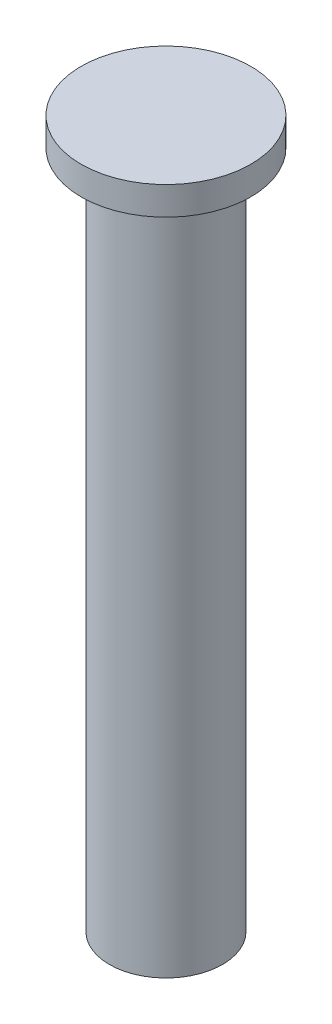
ISO-10303-21;
HEADER;
FILE_DESCRIPTION(('STEP AP214'),'2;1');
FILE_NAME('part.step','',(''),(''),'','','');
FILE_SCHEMA(('AUTOMOTIVE_DESIGN { 1 0 10303 214 1 1 1 1 }'));
ENDSEC;
DATA;
#1=APPLICATION_CONTEXT('core data for automotive mechanical design processes');
#2=APPLICATION_PROTOCOL_DEFINITION('international standard','automotive_design',2000,#1);
#3=PRODUCT_CONTEXT('',#1,'mechanical');
#4=PRODUCT('Part','Part','',(#3));
#5=PRODUCT_RELATED_PRODUCT_CATEGORY('part','',(#4));
#6=PRODUCT_DEFINITION_FORMATION('','',#4);
#7=PRODUCT_DEFINITION_CONTEXT('part definition',#1,'design');
#8=PRODUCT_DEFINITION('design','',#6,#7);
#9=PRODUCT_DEFINITION_SHAPE('','',#8);
#10=(LENGTH_UNIT() NAMED_UNIT(*) SI_UNIT(.MILLI.,.METRE.));
#11=(NAMED_UNIT(*) PLANE_ANGLE_UNIT() SI_UNIT($,.RADIAN.));
#12=(NAMED_UNIT(*) SI_UNIT($,.STERADIAN.) SOLID_ANGLE_UNIT());
#13=UNCERTAINTY_MEASURE_WITH_UNIT(LENGTH_MEASURE(1.E-05),#10,'distance_accuracy_value','');
#14=(GEOMETRIC_REPRESENTATION_CONTEXT(3) GLOBAL_UNCERTAINTY_ASSIGNED_CONTEXT((#13)) GLOBAL_UNIT_ASSIGNED_CONTEXT((#10,
#11,#12)) REPRESENTATION_CONTEXT('',''));
#15=CARTESIAN_POINT('',(0.,0.,0.));
#16=DIRECTION('',(0.,0.,1.));
#17=DIRECTION('',(1.,0.,0.));
#18=AXIS2_PLACEMENT_3D('',#15,#16,#17);
#19=CARTESIAN_POINT('',(0.,120.,0.));
#20=DIRECTION('',(0.,-1.,0.));
#21=DIRECTION('',(0.,0.,-1.));
#22=AXIS2_PLACEMENT_3D('',#19,#20,#21);
#23=CYLINDRICAL_SURFACE('',#22,10.);
#24=CARTESIAN_POINT('',(0.,120.,0.));
#25=DIRECTION('',(0.,1.,0.));
#26=DIRECTION('',(0.,0.,1.));
#27=AXIS2_PLACEMENT_3D('',#24,#25,#26);
#28=CIRCLE('',#27,10.);
#29=CARTESIAN_POINT('',(0.,120.,10.));
#30=VERTEX_POINT('',#29);
#31=EDGE_CURVE('E10',#30,#30,#28,.T.);
#32=ORIENTED_EDGE('',*,*,#31,.F.);
#33=EDGE_LOOP('',(#32));
#34=FACE_BOUND('',#33,.T.);
#35=CARTESIAN_POINT('',(0.,0.,0.));
#36=DIRECTION('',(0.,1.,0.));
#37=DIRECTION('',(0.,0.,1.));
#38=AXIS2_PLACEMENT_3D('',#35,#36,#37);
#39=CIRCLE('',#38,10.);
#40=CARTESIAN_POINT('',(0.,0.,10.));
#41=VERTEX_POINT('',#40);
#42=EDGE_CURVE('E35',#41,#41,#39,.T.);
#43=ORIENTED_EDGE('',*,*,#42,.T.);
#44=EDGE_LOOP('',(#43));
#45=FACE_BOUND('',#44,.T.);
#46=ADVANCED_FACE('F32',(#34,#45),#23,.T.);
#47=CARTESIAN_POINT('',(0.,0.,0.));
#48=DIRECTION('',(0.,1.,0.));
#49=DIRECTION('',(0.,0.,1.));
#50=AXIS2_PLACEMENT_3D('',#47,#48,#49);
#51=PLANE('',#50);
#52=ORIENTED_EDGE('',*,*,#42,.F.);
#53=EDGE_LOOP('',(#52));
#54=FACE_BOUND('',#53,.T.);
#55=ADVANCED_FACE('F60',(#54),#51,.F.);
#56=CARTESIAN_POINT('',(0.,120.,0.));
#57=DIRECTION('',(0.,1.,0.));
#58=DIRECTION('',(0.,0.,1.));
#59=AXIS2_PLACEMENT_3D('',#56,#57,#58);
#60=PLANE('',#59);
#61=CARTESIAN_POINT('',(0.,120.,0.));
#62=DIRECTION('',(0.,1.,0.));
#63=DIRECTION('',(0.,0.,1.));
#64=AXIS2_PLACEMENT_3D('',#61,#62,#63);
#65=CIRCLE('',#64,15.);
#66=CARTESIAN_POINT('',(0.,120.,15.));
#67=VERTEX_POINT('',#66);
#68=EDGE_CURVE('E44',#67,#67,#65,.T.);
#69=ORIENTED_EDGE('',*,*,#68,.F.);
#70=EDGE_LOOP('',(#69));
#71=FACE_BOUND('',#70,.T.);
#72=ORIENTED_EDGE('',*,*,#31,.T.);
#73=EDGE_LOOP('',(#72));
#74=FACE_BOUND('',#73,.T.);
#75=ADVANCED_FACE('F55',(#71,#74),#60,.F.);
#76=CARTESIAN_POINT('',(0.,125.,0.));
#77=DIRECTION('',(0.,-1.,0.));
#78=DIRECTION('',(0.,0.,-1.));
#79=AXIS2_PLACEMENT_3D('',#76,#77,#78);
#80=CYLINDRICAL_SURFACE('',#79,15.);
#81=CARTESIAN_POINT('',(0.,125.,0.));
#82=DIRECTION('',(0.,1.,0.));
#83=DIRECTION('',(0.,0.,1.));
#84=AXIS2_PLACEMENT_3D('',#81,#82,#83);
#85=CIRCLE('',#84,15.);
#86=CARTESIAN_POINT('',(0.,125.,15.));
#87=VERTEX_POINT('',#86);
#88=EDGE_CURVE('E42',#87,#87,#85,.T.);
#89=ORIENTED_EDGE('',*,*,#88,.F.);
#90=EDGE_LOOP('',(#89));
#91=FACE_BOUND('',#90,.T.);
#92=ORIENTED_EDGE('',*,*,#68,.T.);
#93=EDGE_LOOP('',(#92));
#94=FACE_BOUND('',#93,.T.);
#95=ADVANCED_FACE('F52',(#91,#94),#80,.T.);
#96=CARTESIAN_POINT('',(0.,125.,0.));
#97=DIRECTION('',(0.,1.,0.));
#98=DIRECTION('',(0.,0.,1.));
#99=AXIS2_PLACEMENT_3D('',#96,#97,#98);
#100=PLANE('',#99);
#101=ORIENTED_EDGE('',*,*,#88,.T.);
#102=EDGE_LOOP('',(#101));
#103=FACE_BOUND('',#102,.T.);
#104=ADVANCED_FACE('F50',(#103),#100,.T.);
#105=CLOSED_SHELL('',(#46,#55,#75,#95,#104));
#106=MANIFOLD_SOLID_BREP('B2',#105);
#107=ADVANCED_BREP_SHAPE_REPRESENTATION('',(#18,#106),#14);
#108=SHAPE_DEFINITION_REPRESENTATION(#9,#107);
ENDSEC;
END-ISO-10303-21;
